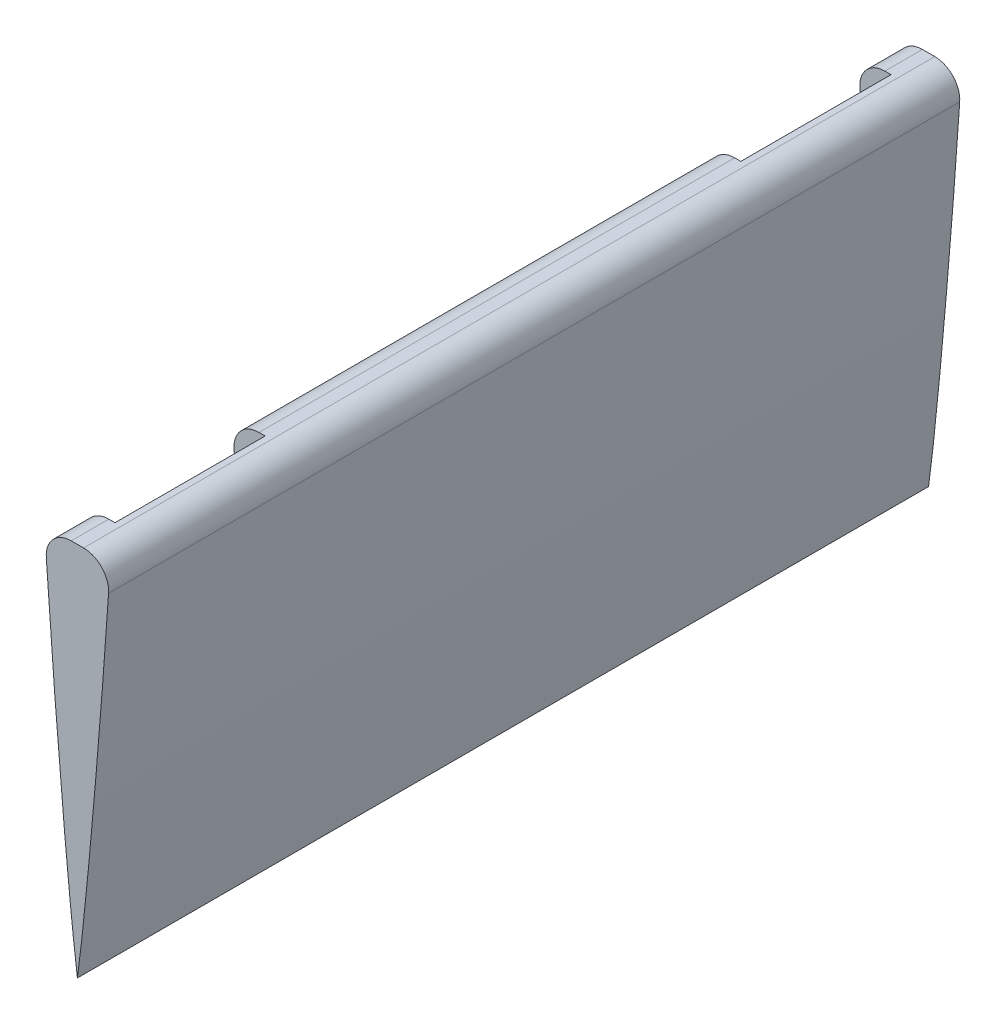
ISO-10303-21;
HEADER;
FILE_DESCRIPTION(('STEP AP214'),'2;1');
FILE_NAME('part.step','',(''),(''),'','','');
FILE_SCHEMA(('AUTOMOTIVE_DESIGN { 1 0 10303 214 1 1 1 1 }'));
ENDSEC;
DATA;
#1=APPLICATION_CONTEXT('core data for automotive mechanical design processes');
#2=APPLICATION_PROTOCOL_DEFINITION('international standard','automotive_design',2000,#1);
#3=PRODUCT_CONTEXT('',#1,'mechanical');
#4=PRODUCT('Part','Part','',(#3));
#5=PRODUCT_RELATED_PRODUCT_CATEGORY('part','',(#4));
#6=PRODUCT_DEFINITION_FORMATION('','',#4);
#7=PRODUCT_DEFINITION_CONTEXT('part definition',#1,'design');
#8=PRODUCT_DEFINITION('design','',#6,#7);
#9=PRODUCT_DEFINITION_SHAPE('','',#8);
#10=(LENGTH_UNIT() NAMED_UNIT(*) SI_UNIT(.MILLI.,.METRE.));
#11=(NAMED_UNIT(*) PLANE_ANGLE_UNIT() SI_UNIT($,.RADIAN.));
#12=(NAMED_UNIT(*) SI_UNIT($,.STERADIAN.) SOLID_ANGLE_UNIT());
#13=UNCERTAINTY_MEASURE_WITH_UNIT(LENGTH_MEASURE(1.E-05),#10,'distance_accuracy_value','');
#14=(GEOMETRIC_REPRESENTATION_CONTEXT(3) GLOBAL_UNCERTAINTY_ASSIGNED_CONTEXT((#13)) GLOBAL_UNIT_ASSIGNED_CONTEXT((#10,
#11,#12)) REPRESENTATION_CONTEXT('',''));
#15=CARTESIAN_POINT('',(0.,0.,0.));
#16=DIRECTION('',(0.,0.,1.));
#17=DIRECTION('',(1.,0.,0.));
#18=AXIS2_PLACEMENT_3D('',#15,#16,#17);
#19=CARTESIAN_POINT('',(-2.4886684159476,-667.135965963535,69.0000000000001));
#20=CARTESIAN_POINT('',(-2.42539379858326,-668.064554688061,69.0000000000001));
#21=CARTESIAN_POINT('',(-2.24900919174135,-670.58228504223,69.0000000000001));
#22=CARTESIAN_POINT('',(-1.95053516599277,-674.572636177726,69.0000000000001));
#23=CARTESIAN_POINT('',(-1.59558045491599,-678.965682707439,69.0000000000001));
#24=CARTESIAN_POINT('',(-1.2543479227875,-682.938251461165,69.0000000000001));
#25=CARTESIAN_POINT('',(-0.936673997120256,-686.422094746995,69.0000000000001));
#26=CARTESIAN_POINT('',(-0.649135542921568,-689.357660004493,69.0000000000001));
#27=CARTESIAN_POINT('',(-0.403246318074824,-691.694524122811,69.0000000000001));
#28=CARTESIAN_POINT('',(-0.207189019120028,-693.392683730012,69.0000000000001));
#29=CARTESIAN_POINT('',(-0.0904433778749418,-694.306731800449,69.0000000000001));
#30=CARTESIAN_POINT('',(-0.0463124999999785,-694.65225,69.0000000000001));
#31=B_SPLINE_CURVE_WITH_KNOTS('',3,(#19,#20,#21,#22,#23,#24,#25,#26,#27,#28,#29,#30),
.UNSPECIFIED.,.F.,.F.,(4,1,1,1,1,1,1,1,1,4),(0.0130459743979009,0.0300624816189242,
0.0591896904022461,0.0862039948092875,0.110640853612541,0.132086404942711,0.150162148552736,
0.164567507976323,0.175046194928288,0.181414509479025),.UNSPECIFIED.);
#32=DIRECTION('',(0.,0.,-1.));
#33=VECTOR('',#32,1.);
#34=SURFACE_OF_LINEAR_EXTRUSION('',#31,#33);
#35=CARTESIAN_POINT('',(-2.4886684159476,-667.135965963535,66.0000000000001));
#36=CARTESIAN_POINT('',(-2.42539379858326,-668.064554688061,66.0000000000001));
#37=CARTESIAN_POINT('',(-2.24900919174135,-670.58228504223,66.0000000000001));
#38=CARTESIAN_POINT('',(-1.95053516599277,-674.572636177726,66.0000000000001));
#39=CARTESIAN_POINT('',(-1.59558045491599,-678.965682707439,66.0000000000001));
#40=CARTESIAN_POINT('',(-1.2543479227875,-682.938251461165,66.0000000000001));
#41=CARTESIAN_POINT('',(-0.936673997120256,-686.422094746995,66.0000000000001));
#42=CARTESIAN_POINT('',(-0.649135542921568,-689.357660004493,66.0000000000001));
#43=CARTESIAN_POINT('',(-0.403246318074824,-691.694524122811,66.0000000000001));
#44=CARTESIAN_POINT('',(-0.207189019120028,-693.392683730012,66.0000000000001));
#45=CARTESIAN_POINT('',(-0.0904433778749418,-694.306731800449,66.0000000000001));
#46=CARTESIAN_POINT('',(-0.0463124999999785,-694.65225,66.0000000000001));
#47=B_SPLINE_CURVE_WITH_KNOTS('',3,(#35,#36,#37,#38,#39,#40,#41,#42,#43,#44,#45,#46),
.UNSPECIFIED.,.F.,.F.,(4,1,1,1,1,1,1,1,1,4),(0.0130459743979009,0.0300624816189242,
0.0591896904022461,0.0862039948092875,0.110640853612541,0.132086404942711,0.150162148552736,
0.164567507976323,0.175046194928288,0.181414509479025),.UNSPECIFIED.);
#48=CARTESIAN_POINT('',(-1.75338053031172,-677.,66.0000000000002));
#49=VERTEX_POINT('',#48);
#50=CARTESIAN_POINT('',(-2.4886684159476,-667.135965963535,66.0000000000002));
#51=VERTEX_POINT('',#50);
#52=EDGE_CURVE('E141',#49,#51,#47,.F.);
#53=ORIENTED_EDGE('',*,*,#52,.F.);
#54=DIRECTION('',(0.,0.,-1.));
#55=VECTOR('',#54,1.);
#56=CARTESIAN_POINT('',(-1.75338053031172,-677.,69.0000000000001));
#57=LINE('',#56,#55);
#58=CARTESIAN_POINT('',(-1.75338053031172,-677.,54.0000000000002));
#59=VERTEX_POINT('',#58);
#60=EDGE_CURVE('E11',#59,#49,#57,.F.);
#61=ORIENTED_EDGE('',*,*,#60,.F.);
#62=CARTESIAN_POINT('',(-2.4886684159476,-667.135965963535,54.0000000000002));
#63=CARTESIAN_POINT('',(-2.42539379858326,-668.064554688061,54.0000000000002));
#64=CARTESIAN_POINT('',(-2.24900919174135,-670.58228504223,54.0000000000002));
#65=CARTESIAN_POINT('',(-1.95053516599277,-674.572636177726,54.0000000000002));
#66=CARTESIAN_POINT('',(-1.59558045491599,-678.965682707439,54.0000000000002));
#67=CARTESIAN_POINT('',(-1.2543479227875,-682.938251461165,54.0000000000002));
#68=CARTESIAN_POINT('',(-0.936673997120256,-686.422094746995,54.0000000000002));
#69=CARTESIAN_POINT('',(-0.649135542921568,-689.357660004493,54.0000000000002));
#70=CARTESIAN_POINT('',(-0.403246318074824,-691.694524122811,54.0000000000002));
#71=CARTESIAN_POINT('',(-0.207189019120028,-693.392683730012,54.0000000000002));
#72=CARTESIAN_POINT('',(-0.0904433778749418,-694.306731800449,54.0000000000002));
#73=CARTESIAN_POINT('',(-0.0463124999999785,-694.65225,54.0000000000002));
#74=B_SPLINE_CURVE_WITH_KNOTS('',3,(#62,#63,#64,#65,#66,#67,#68,#69,#70,#71,#72,#73),
.UNSPECIFIED.,.F.,.F.,(4,1,1,1,1,1,1,1,1,4),(0.0130459743979009,0.0300624816189242,
0.0591896904022461,0.0862039948092875,0.110640853612541,0.132086404942711,0.150162148552736,
0.164567507976323,0.175046194928288,0.181414509479025),.UNSPECIFIED.);
#75=CARTESIAN_POINT('',(-2.4886684159476,-667.135965963535,54.0000000000002));
#76=VERTEX_POINT('',#75);
#77=EDGE_CURVE('E218',#76,#59,#74,.T.);
#78=ORIENTED_EDGE('',*,*,#77,.F.);
#79=DIRECTION('',(0.,0.,-1.));
#80=VECTOR('',#79,1.);
#81=CARTESIAN_POINT('',(-2.4886684159476,-667.135965963535,69.0000000000001));
#82=LINE('',#81,#80);
#83=CARTESIAN_POINT('',(-2.4886684159476,-667.135965963535,16.));
#84=VERTEX_POINT('',#83);
#85=EDGE_CURVE('E162',#76,#84,#82,.T.);
#86=ORIENTED_EDGE('',*,*,#85,.T.);
#87=CARTESIAN_POINT('',(-2.4886684159476,-667.135965963535,16.));
#88=CARTESIAN_POINT('',(-2.42539379858326,-668.064554688061,16.));
#89=CARTESIAN_POINT('',(-2.24900919174135,-670.58228504223,16.));
#90=CARTESIAN_POINT('',(-1.95053516599277,-674.572636177726,16.));
#91=CARTESIAN_POINT('',(-1.59558045491599,-678.965682707439,16.));
#92=CARTESIAN_POINT('',(-1.2543479227875,-682.938251461165,16.));
#93=CARTESIAN_POINT('',(-0.936673997120256,-686.422094746995,16.));
#94=CARTESIAN_POINT('',(-0.649135542921568,-689.357660004493,16.));
#95=CARTESIAN_POINT('',(-0.403246318074824,-691.694524122811,16.));
#96=CARTESIAN_POINT('',(-0.207189019120028,-693.392683730012,16.));
#97=CARTESIAN_POINT('',(-0.0904433778749418,-694.306731800449,16.));
#98=CARTESIAN_POINT('',(-0.0463124999999785,-694.65225,16.));
#99=B_SPLINE_CURVE_WITH_KNOTS('',3,(#87,#88,#89,#90,#91,#92,#93,#94,#95,#96,#97,#98),
.UNSPECIFIED.,.F.,.F.,(4,1,1,1,1,1,1,1,1,4),(0.0130459743979009,0.0300624816189242,
0.0591896904022461,0.0862039948092875,0.110640853612541,0.132086404942711,0.150162148552736,
0.164567507976323,0.175046194928288,0.181414509479025),.UNSPECIFIED.);
#100=CARTESIAN_POINT('',(-1.75338053031172,-677.,16.));
#101=VERTEX_POINT('',#100);
#102=EDGE_CURVE('E207',#101,#84,#99,.F.);
#103=ORIENTED_EDGE('',*,*,#102,.F.);
#104=DIRECTION('',(0.,0.,-1.));
#105=VECTOR('',#104,1.);
#106=CARTESIAN_POINT('',(-1.75338053031172,-677.,69.0000000000001));
#107=LINE('',#106,#105);
#108=CARTESIAN_POINT('',(-1.75338053031172,-677.,4.00000000000003));
#109=VERTEX_POINT('',#108);
#110=EDGE_CURVE('E50',#109,#101,#107,.F.);
#111=ORIENTED_EDGE('',*,*,#110,.F.);
#112=CARTESIAN_POINT('',(-2.4886684159476,-667.135965963535,4.00000000000002));
#113=CARTESIAN_POINT('',(-2.42539379858326,-668.064554688061,4.00000000000002));
#114=CARTESIAN_POINT('',(-2.24900919174135,-670.58228504223,4.00000000000002));
#115=CARTESIAN_POINT('',(-1.95053516599277,-674.572636177726,4.00000000000002));
#116=CARTESIAN_POINT('',(-1.59558045491599,-678.965682707439,4.00000000000002));
#117=CARTESIAN_POINT('',(-1.2543479227875,-682.938251461165,4.00000000000002));
#118=CARTESIAN_POINT('',(-0.936673997120256,-686.422094746995,4.00000000000002));
#119=CARTESIAN_POINT('',(-0.649135542921568,-689.357660004493,4.00000000000002));
#120=CARTESIAN_POINT('',(-0.403246318074824,-691.694524122811,4.00000000000002));
#121=CARTESIAN_POINT('',(-0.207189019120028,-693.392683730012,4.00000000000002));
#122=CARTESIAN_POINT('',(-0.0904433778749418,-694.306731800449,4.00000000000002));
#123=CARTESIAN_POINT('',(-0.0463124999999785,-694.65225,4.00000000000002));
#124=B_SPLINE_CURVE_WITH_KNOTS('',3,(#112,#113,#114,#115,#116,#117,#118,#119,#120,#121,#122,
#123),.UNSPECIFIED.,.F.,.F.,(4,1,1,1,1,1,1,1,1,4),(0.0130459743979009,0.0300624816189242,
0.0591896904022461,0.0862039948092875,0.110640853612541,0.132086404942711,0.150162148552736,
0.164567507976323,0.175046194928288,0.181414509479025),.UNSPECIFIED.);
#125=CARTESIAN_POINT('',(-2.4886684159476,-667.135965963535,4.00000000000003));
#126=VERTEX_POINT('',#125);
#127=EDGE_CURVE('E219',#126,#109,#124,.T.);
#128=ORIENTED_EDGE('',*,*,#127,.F.);
#129=CARTESIAN_POINT('',(-2.4886684159476,-667.135965963535,1.00000000000007));
#130=VERTEX_POINT('',#129);
#131=EDGE_CURVE('E90',#126,#130,#82,.T.);
#132=ORIENTED_EDGE('',*,*,#131,.T.);
#133=CARTESIAN_POINT('',(-2.4886684159476,-667.135965963535,1.00000000000007));
#134=CARTESIAN_POINT('',(-2.42539379858326,-668.064554688061,1.00000000000007));
#135=CARTESIAN_POINT('',(-2.24900919174135,-670.58228504223,1.00000000000007));
#136=CARTESIAN_POINT('',(-1.95053516599277,-674.572636177726,1.00000000000007));
#137=CARTESIAN_POINT('',(-1.59558045491599,-678.965682707439,1.00000000000007));
#138=CARTESIAN_POINT('',(-1.2543479227875,-682.938251461165,1.00000000000007));
#139=CARTESIAN_POINT('',(-0.936673997120256,-686.422094746995,1.00000000000007));
#140=CARTESIAN_POINT('',(-0.649135542921568,-689.357660004493,1.00000000000007));
#141=CARTESIAN_POINT('',(-0.403246318074824,-691.694524122811,1.00000000000007));
#142=CARTESIAN_POINT('',(-0.207189019120028,-693.392683730012,1.00000000000007));
#143=CARTESIAN_POINT('',(-0.0904433778749418,-694.306731800449,1.00000000000007));
#144=CARTESIAN_POINT('',(-0.0463124999999785,-694.65225,1.00000000000007));
#145=B_SPLINE_CURVE_WITH_KNOTS('',3,(#133,#134,#135,#136,#137,#138,#139,#140,#141,#142,#143,
#144),.UNSPECIFIED.,.F.,.F.,(4,1,1,1,1,1,1,1,1,4),(0.0130459743979009,0.0300624816189242,
0.0591896904022461,0.0862039948092875,0.110640853612541,0.132086404942711,0.150162148552736,
0.164567507976323,0.175046194928288,0.181414509479025),.UNSPECIFIED.);
#146=CARTESIAN_POINT('',(-0.0463124999999785,-694.65225,1.00000000000007));
#147=VERTEX_POINT('',#146);
#148=EDGE_CURVE('E136',#130,#147,#145,.T.);
#149=ORIENTED_EDGE('',*,*,#148,.T.);
#150=DIRECTION('',(0.,0.,-1.));
#151=VECTOR('',#150,1.);
#152=CARTESIAN_POINT('',(-0.0463124999999785,-694.65225,69.0000000000001));
#153=LINE('',#152,#151);
#154=CARTESIAN_POINT('',(-0.0463124999999785,-694.65225,69.0000000000001));
#155=VERTEX_POINT('',#154);
#156=EDGE_CURVE('E170',#155,#147,#153,.T.);
#157=ORIENTED_EDGE('',*,*,#156,.F.);
#158=CARTESIAN_POINT('',(-2.4886684159476,-667.135965963535,69.0000000000001));
#159=VERTEX_POINT('',#158);
#160=EDGE_CURVE('E158',#159,#155,#31,.T.);
#161=ORIENTED_EDGE('',*,*,#160,.F.);
#162=EDGE_CURVE('E159',#159,#51,#82,.T.);
#163=ORIENTED_EDGE('',*,*,#162,.T.);
#164=EDGE_LOOP('',(#53,#61,#78,#86,#103,#111,#128,#132,#149,#157,#161,#163));
#165=FACE_BOUND('',#164,.T.);
#166=ADVANCED_FACE('F41',(#165),#34,.F.);
#167=CARTESIAN_POINT('',(-0.493295454128175,-665.,69.0000000000001));
#168=DIRECTION('',(2.25062452770313E-13,-1.,0.));
#169=DIRECTION('',(1.,2.25062452770313E-13,0.));
#170=AXIS2_PLACEMENT_3D('',#167,#168,#169);
#171=PLANE('',#170);
#172=DIRECTION('',(1.,0.,0.));
#173=VECTOR('',#172,1.);
#174=CARTESIAN_POINT('',(-2.4932954541282,-665.,66.0000000000002));
#175=LINE('',#174,#173);
#176=CARTESIAN_POINT('',(-0.493295454128205,-665.,66.0000000000002));
#177=VERTEX_POINT('',#176);
#178=CARTESIAN_POINT('',(0.,-665.,66.0000000000002));
#179=VERTEX_POINT('',#178);
#180=EDGE_CURVE('E224',#177,#179,#175,.T.);
#181=ORIENTED_EDGE('',*,*,#180,.F.);
#182=DIRECTION('',(0.,0.,-1.));
#183=VECTOR('',#182,1.);
#184=CARTESIAN_POINT('',(-0.493295454128175,-665.,69.0000000000001));
#185=LINE('',#184,#183);
#186=CARTESIAN_POINT('',(-0.493295454128175,-665.,69.0000000000001));
#187=VERTEX_POINT('',#186);
#188=EDGE_CURVE('E127',#187,#177,#185,.T.);
#189=ORIENTED_EDGE('',*,*,#188,.F.);
#190=DIRECTION('',(-1.,-2.25062452770313E-13,0.));
#191=VECTOR('',#190,1.);
#192=CARTESIAN_POINT('',(-0.493295454128175,-665.,69.0000000000001));
#193=LINE('',#192,#191);
#194=CARTESIAN_POINT('',(0.49329561067124,-665.,69.0000000000001));
#195=VERTEX_POINT('',#194);
#196=EDGE_CURVE('E111',#195,#187,#193,.T.);
#197=ORIENTED_EDGE('',*,*,#196,.F.);
#198=DIRECTION('',(0.,0.,-1.));
#199=VECTOR('',#198,1.);
#200=CARTESIAN_POINT('',(0.49329561067124,-665.,69.0000000000001));
#201=LINE('',#200,#199);
#202=CARTESIAN_POINT('',(0.49329561067124,-665.,1.00000000000007));
#203=VERTEX_POINT('',#202);
#204=EDGE_CURVE('E120',#195,#203,#201,.T.);
#205=ORIENTED_EDGE('',*,*,#204,.T.);
#206=DIRECTION('',(-1.,-2.25062452770313E-13,0.));
#207=VECTOR('',#206,1.);
#208=CARTESIAN_POINT('',(-0.493295454128175,-665.,1.00000000000007));
#209=LINE('',#208,#207);
#210=CARTESIAN_POINT('',(-0.493295454128175,-665.,1.00000000000007));
#211=VERTEX_POINT('',#210);
#212=EDGE_CURVE('E154',#203,#211,#209,.T.);
#213=ORIENTED_EDGE('',*,*,#212,.T.);
#214=CARTESIAN_POINT('',(-0.493295454128205,-665.,4.00000000000003));
#215=VERTEX_POINT('',#214);
#216=EDGE_CURVE('E82',#215,#211,#185,.T.);
#217=ORIENTED_EDGE('',*,*,#216,.F.);
#218=DIRECTION('',(1.,0.,0.));
#219=VECTOR('',#218,1.);
#220=CARTESIAN_POINT('',(-2.4932954541282,-665.,4.00000000000003));
#221=LINE('',#220,#219);
#222=CARTESIAN_POINT('',(0.,-665.,4.00000000000003));
#223=VERTEX_POINT('',#222);
#224=EDGE_CURVE('E364',#215,#223,#221,.T.);
#225=ORIENTED_EDGE('',*,*,#224,.T.);
#226=DIRECTION('',(0.,0.,-1.));
#227=VECTOR('',#226,1.);
#228=CARTESIAN_POINT('',(0.,-665.,16.));
#229=LINE('',#228,#227);
#230=CARTESIAN_POINT('',(0.,-665.,16.));
#231=VERTEX_POINT('',#230);
#232=EDGE_CURVE('E356',#231,#223,#229,.T.);
#233=ORIENTED_EDGE('',*,*,#232,.F.);
#234=DIRECTION('',(1.,0.,0.));
#235=VECTOR('',#234,1.);
#236=CARTESIAN_POINT('',(-2.4932954541282,-665.,16.));
#237=LINE('',#236,#235);
#238=CARTESIAN_POINT('',(-0.493295454128205,-665.,16.));
#239=VERTEX_POINT('',#238);
#240=EDGE_CURVE('E335',#239,#231,#237,.T.);
#241=ORIENTED_EDGE('',*,*,#240,.F.);
#242=CARTESIAN_POINT('',(-0.493295454128205,-665.,54.0000000000002));
#243=VERTEX_POINT('',#242);
#244=EDGE_CURVE('E163',#243,#239,#185,.T.);
#245=ORIENTED_EDGE('',*,*,#244,.F.);
#246=DIRECTION('',(1.,0.,0.));
#247=VECTOR('',#246,1.);
#248=CARTESIAN_POINT('',(-2.4932954541282,-665.,54.0000000000002));
#249=LINE('',#248,#247);
#250=CARTESIAN_POINT('',(0.,-665.,54.0000000000002));
#251=VERTEX_POINT('',#250);
#252=EDGE_CURVE('E341',#243,#251,#249,.T.);
#253=ORIENTED_EDGE('',*,*,#252,.T.);
#254=DIRECTION('',(0.,0.,-1.));
#255=VECTOR('',#254,1.);
#256=CARTESIAN_POINT('',(0.,-665.,66.0000000000002));
#257=LINE('',#256,#255);
#258=EDGE_CURVE('E327',#179,#251,#257,.T.);
#259=ORIENTED_EDGE('',*,*,#258,.F.);
#260=EDGE_LOOP('',(#181,#189,#197,#205,#213,#217,#225,#233,#241,#245,#253,#259));
#261=FACE_BOUND('',#260,.T.);
#262=ADVANCED_FACE('F130',(#261),#171,.F.);
#263=CARTESIAN_POINT('',(-0.493295454128205,-667.,69.0000000000001));
#264=DIRECTION('',(0.,0.,-1.));
#265=DIRECTION('',(-1.,0.,0.));
#266=AXIS2_PLACEMENT_3D('',#263,#264,#265);
#267=CYLINDRICAL_SURFACE('',#266,2.);
#268=CARTESIAN_POINT('',(-0.493295454128205,-667.,66.0000000000002));
#269=DIRECTION('',(0.,0.,-1.));
#270=DIRECTION('',(0.,1.,0.));
#271=AXIS2_PLACEMENT_3D('',#268,#269,#270);
#272=CIRCLE('',#271,2.);
#273=EDGE_CURVE('E182',#51,#177,#272,.T.);
#274=ORIENTED_EDGE('',*,*,#273,.F.);
#275=ORIENTED_EDGE('',*,*,#162,.F.);
#276=CARTESIAN_POINT('',(-0.493295454128205,-667.,69.0000000000001));
#277=DIRECTION('',(0.,0.,1.));
#278=DIRECTION('',(-1.,0.,0.));
#279=AXIS2_PLACEMENT_3D('',#276,#277,#278);
#280=CIRCLE('',#279,2.);
#281=EDGE_CURVE('E58',#187,#159,#280,.T.);
#282=ORIENTED_EDGE('',*,*,#281,.F.);
#283=ORIENTED_EDGE('',*,*,#188,.T.);
#284=EDGE_LOOP('',(#274,#275,#282,#283));
#285=FACE_BOUND('',#284,.T.);
#286=ADVANCED_FACE('F273',(#285),#267,.T.);
#287=CARTESIAN_POINT('',(-0.493295454128205,-667.,54.0000000000002));
#288=DIRECTION('',(0.,0.,1.));
#289=DIRECTION('',(1.,0.,0.));
#290=AXIS2_PLACEMENT_3D('',#287,#288,#289);
#291=CIRCLE('',#290,2.);
#292=EDGE_CURVE('E179',#243,#76,#291,.T.);
#293=ORIENTED_EDGE('',*,*,#292,.F.);
#294=ORIENTED_EDGE('',*,*,#244,.T.);
#295=CARTESIAN_POINT('',(-0.493295454128205,-667.,16.));
#296=DIRECTION('',(0.,0.,-1.));
#297=DIRECTION('',(-1.,0.,0.));
#298=AXIS2_PLACEMENT_3D('',#295,#296,#297);
#299=CIRCLE('',#298,2.);
#300=EDGE_CURVE('E176',#84,#239,#299,.T.);
#301=ORIENTED_EDGE('',*,*,#300,.F.);
#302=ORIENTED_EDGE('',*,*,#85,.F.);
#303=EDGE_LOOP('',(#293,#294,#301,#302));
#304=FACE_BOUND('',#303,.T.);
#305=ADVANCED_FACE('F271',(#304),#267,.T.);
#306=CARTESIAN_POINT('',(-0.493295454128205,-667.,4.00000000000003));
#307=DIRECTION('',(0.,0.,1.));
#308=DIRECTION('',(0.,-1.,0.));
#309=AXIS2_PLACEMENT_3D('',#306,#307,#308);
#310=CIRCLE('',#309,2.);
#311=EDGE_CURVE('E173',#215,#126,#310,.T.);
#312=ORIENTED_EDGE('',*,*,#311,.F.);
#313=ORIENTED_EDGE('',*,*,#216,.T.);
#314=CARTESIAN_POINT('',(-0.493295454128205,-667.,1.00000000000007));
#315=DIRECTION('',(0.,0.,1.));
#316=DIRECTION('',(-1.,0.,0.));
#317=AXIS2_PLACEMENT_3D('',#314,#315,#316);
#318=CIRCLE('',#317,2.);
#319=EDGE_CURVE('E156',#211,#130,#318,.T.);
#320=ORIENTED_EDGE('',*,*,#319,.T.);
#321=ORIENTED_EDGE('',*,*,#131,.F.);
#322=EDGE_LOOP('',(#312,#313,#320,#321));
#323=FACE_BOUND('',#322,.T.);
#324=ADVANCED_FACE('F267',(#323),#267,.T.);
#325=CARTESIAN_POINT('',(-0.0463124999999785,-694.65225,69.0000000000001));
#326=DIRECTION('',(0.991248116150498,0.132012015468629,0.));
#327=DIRECTION('',(-0.132012015468629,0.991248116150498,0.));
#328=AXIS2_PLACEMENT_3D('',#325,#326,#327);
#329=PLANE('',#328);
#330=DIRECTION('',(0.132012015468629,-0.991248116150498,0.));
#331=VECTOR('',#330,1.);
#332=CARTESIAN_POINT('',(-0.0463124999999785,-694.65225,1.00000000000007));
#333=LINE('',#332,#331);
#334=CARTESIAN_POINT('',(0.,-695.,1.00000000000007));
#335=VERTEX_POINT('',#334);
#336=EDGE_CURVE('E140',#147,#335,#333,.T.);
#337=ORIENTED_EDGE('',*,*,#336,.T.);
#338=DIRECTION('',(0.,0.,-1.));
#339=VECTOR('',#338,1.);
#340=CARTESIAN_POINT('',(0.,-695.,69.0000000000001));
#341=LINE('',#340,#339);
#342=CARTESIAN_POINT('',(0.,-695.,69.0000000000001));
#343=VERTEX_POINT('',#342);
#344=EDGE_CURVE('E166',#343,#335,#341,.T.);
#345=ORIENTED_EDGE('',*,*,#344,.F.);
#346=DIRECTION('',(0.132012015468629,-0.991248116150498,0.));
#347=VECTOR('',#346,1.);
#348=CARTESIAN_POINT('',(-0.0463124999999785,-694.65225,69.0000000000001));
#349=LINE('',#348,#347);
#350=EDGE_CURVE('E98',#155,#343,#349,.T.);
#351=ORIENTED_EDGE('',*,*,#350,.F.);
#352=ORIENTED_EDGE('',*,*,#156,.T.);
#353=EDGE_LOOP('',(#337,#345,#351,#352));
#354=FACE_BOUND('',#353,.T.);
#355=ADVANCED_FACE('F263',(#354),#329,.F.);
#356=CARTESIAN_POINT('',(0.,-695.,69.0000000000001));
#357=CARTESIAN_POINT('',(0.0155220726936815,-694.884094444943,69.0000000000001));
#358=CARTESIAN_POINT('',(0.0772789265039087,-694.422947112321,69.0000000000001));
#359=CARTESIAN_POINT('',(0.206148599416014,-693.392547034144,69.0000000000001));
#360=CARTESIAN_POINT('',(0.403716275844514,-691.694585868359,69.0000000000001));
#361=CARTESIAN_POINT('',(0.648953840791184,-689.357636131502,69.0000000000001));
#362=CARTESIAN_POINT('',(0.936738042792572,-686.422103161655,69.0000000000001));
#363=CARTESIAN_POINT('',(1.2543267550035,-682.938248680029,69.0000000000001));
#364=CARTESIAN_POINT('',(1.59558712219755,-678.965683583422,69.0000000000001));
#365=CARTESIAN_POINT('',(1.95053314593904,-674.57263591232,69.0000000000001));
#366=CARTESIAN_POINT('',(2.2490093743402,-670.5822850249,69.0000000000001));
#367=CARTESIAN_POINT('',(2.42539400678092,-668.064554632797,69.0000000000001));
#368=CARTESIAN_POINT('',(2.48866857947029,-667.135965861106,69.0000000000001));
#369=B_SPLINE_CURVE_WITH_KNOTS('',3,(#356,#357,#358,#359,#360,#361,#362,#363,#364,#365,#366,
#367,#368),.UNSPECIFIED.,.F.,.F.,(4,1,1,1,1,1,1,1,1,1,4),(0.816447501776426,0.818585490515755,
0.824953805066492,0.835432492018457,0.849837851442043,0.867913595052069,0.889359146382239,
0.913796005185492,0.940810309592534,0.969937518375856,0.986954026347075),.UNSPECIFIED.);
#370=DIRECTION('',(0.,0.,-1.));
#371=VECTOR('',#370,1.);
#372=SURFACE_OF_LINEAR_EXTRUSION('',#369,#371);
#373=CARTESIAN_POINT('',(0.,-695.,1.00000000000007));
#374=CARTESIAN_POINT('',(0.0155220726936815,-694.884094444943,1.00000000000007));
#375=CARTESIAN_POINT('',(0.0772789265039087,-694.422947112321,1.00000000000007));
#376=CARTESIAN_POINT('',(0.206148599416014,-693.392547034144,1.00000000000007));
#377=CARTESIAN_POINT('',(0.403716275844514,-691.694585868359,1.00000000000007));
#378=CARTESIAN_POINT('',(0.648953840791184,-689.357636131502,1.00000000000007));
#379=CARTESIAN_POINT('',(0.936738042792572,-686.422103161655,1.00000000000007));
#380=CARTESIAN_POINT('',(1.2543267550035,-682.938248680029,1.00000000000007));
#381=CARTESIAN_POINT('',(1.59558712219755,-678.965683583422,1.00000000000007));
#382=CARTESIAN_POINT('',(1.95053314593904,-674.57263591232,1.00000000000007));
#383=CARTESIAN_POINT('',(2.2490093743402,-670.5822850249,1.00000000000007));
#384=CARTESIAN_POINT('',(2.42539400678092,-668.064554632797,1.00000000000007));
#385=CARTESIAN_POINT('',(2.48866857947029,-667.135965861106,1.00000000000007));
#386=B_SPLINE_CURVE_WITH_KNOTS('',3,(#373,#374,#375,#376,#377,#378,#379,#380,#381,#382,#383,
#384,#385),.UNSPECIFIED.,.F.,.F.,(4,1,1,1,1,1,1,1,1,1,4),(0.816447501776426,0.818585490515755,
0.824953805066492,0.835432492018457,0.849837851442043,0.867913595052069,0.889359146382239,
0.913796005185492,0.940810309592534,0.969937518375856,0.986954026347075),.UNSPECIFIED.);
#387=CARTESIAN_POINT('',(2.48866857947029,-667.135965861106,1.00000000000007));
#388=VERTEX_POINT('',#387);
#389=EDGE_CURVE('E146',#335,#388,#386,.T.);
#390=ORIENTED_EDGE('',*,*,#389,.T.);
#391=DIRECTION('',(0.,0.,-1.));
#392=VECTOR('',#391,1.);
#393=CARTESIAN_POINT('',(2.48866857947029,-667.135965861106,69.0000000000001));
#394=LINE('',#393,#392);
#395=CARTESIAN_POINT('',(2.48866857947029,-667.135965861106,69.0000000000001));
#396=VERTEX_POINT('',#395);
#397=EDGE_CURVE('E126',#396,#388,#394,.T.);
#398=ORIENTED_EDGE('',*,*,#397,.F.);
#399=EDGE_CURVE('E114',#343,#396,#369,.T.);
#400=ORIENTED_EDGE('',*,*,#399,.F.);
#401=ORIENTED_EDGE('',*,*,#344,.T.);
#402=EDGE_LOOP('',(#390,#398,#400,#401));
#403=FACE_BOUND('',#402,.T.);
#404=ADVANCED_FACE('F260',(#403),#372,.F.);
#405=CARTESIAN_POINT('',(0.493295610671315,-667.,69.0000000000001));
#406=DIRECTION('',(0.,0.,-1.));
#407=DIRECTION('',(-1.,0.,0.));
#408=AXIS2_PLACEMENT_3D('',#405,#406,#407);
#409=CYLINDRICAL_SURFACE('',#408,2.00000000000001);
#410=CARTESIAN_POINT('',(0.493295610671315,-667.,1.00000000000007));
#411=DIRECTION('',(0.,0.,1.));
#412=DIRECTION('',(1.,0.,0.));
#413=AXIS2_PLACEMENT_3D('',#410,#411,#412);
#414=CIRCLE('',#413,2.00000000000001);
#415=EDGE_CURVE('E123',#388,#203,#414,.T.);
#416=ORIENTED_EDGE('',*,*,#415,.T.);
#417=ORIENTED_EDGE('',*,*,#204,.F.);
#418=CARTESIAN_POINT('',(0.493295610671315,-667.,69.0000000000001));
#419=DIRECTION('',(0.,0.,1.));
#420=DIRECTION('',(1.,0.,0.));
#421=AXIS2_PLACEMENT_3D('',#418,#419,#420);
#422=CIRCLE('',#421,2.00000000000001);
#423=EDGE_CURVE('E107',#396,#195,#422,.T.);
#424=ORIENTED_EDGE('',*,*,#423,.F.);
#425=ORIENTED_EDGE('',*,*,#397,.T.);
#426=EDGE_LOOP('',(#416,#417,#424,#425));
#427=FACE_BOUND('',#426,.T.);
#428=ADVANCED_FACE('F121',(#427),#409,.T.);
#429=CARTESIAN_POINT('',(-1.42780124034702,-680.908722710936,69.0000000000001));
#430=DIRECTION('',(0.,0.,-1.));
#431=DIRECTION('',(-1.,0.,0.));
#432=AXIS2_PLACEMENT_3D('',#429,#430,#431);
#433=PLANE('',#432);
#434=ORIENTED_EDGE('',*,*,#160,.T.);
#435=ORIENTED_EDGE('',*,*,#350,.T.);
#436=ORIENTED_EDGE('',*,*,#399,.T.);
#437=ORIENTED_EDGE('',*,*,#423,.T.);
#438=ORIENTED_EDGE('',*,*,#196,.T.);
#439=ORIENTED_EDGE('',*,*,#281,.T.);
#440=EDGE_LOOP('',(#434,#435,#436,#437,#438,#439));
#441=FACE_BOUND('',#440,.T.);
#442=ADVANCED_FACE('F109',(#441),#433,.F.);
#443=CARTESIAN_POINT('',(-1.42780124034702,-680.908722710936,1.00000000000007));
#444=DIRECTION('',(0.,0.,-1.));
#445=DIRECTION('',(-1.,0.,0.));
#446=AXIS2_PLACEMENT_3D('',#443,#444,#445);
#447=PLANE('',#446);
#448=ORIENTED_EDGE('',*,*,#148,.F.);
#449=ORIENTED_EDGE('',*,*,#319,.F.);
#450=ORIENTED_EDGE('',*,*,#212,.F.);
#451=ORIENTED_EDGE('',*,*,#415,.F.);
#452=ORIENTED_EDGE('',*,*,#389,.F.);
#453=ORIENTED_EDGE('',*,*,#336,.F.);
#454=EDGE_LOOP('',(#448,#449,#450,#451,#452,#453));
#455=FACE_BOUND('',#454,.T.);
#456=ADVANCED_FACE('F283',(#455),#447,.T.);
#457=CARTESIAN_POINT('',(-2.4932954541282,-677.,16.));
#458=DIRECTION('',(0.,1.,0.));
#459=DIRECTION('',(0.,0.,1.));
#460=AXIS2_PLACEMENT_3D('',#457,#458,#459);
#461=PLANE('',#460);
#462=ORIENTED_EDGE('',*,*,#110,.T.);
#463=DIRECTION('',(1.,0.,0.));
#464=VECTOR('',#463,1.);
#465=CARTESIAN_POINT('',(-2.4932954541282,-677.,16.));
#466=LINE('',#465,#464);
#467=CARTESIAN_POINT('',(0.,-677.,16.));
#468=VERTEX_POINT('',#467);
#469=EDGE_CURVE('E194',#101,#468,#466,.T.);
#470=ORIENTED_EDGE('',*,*,#469,.T.);
#471=DIRECTION('',(0.,0.,1.));
#472=VECTOR('',#471,1.);
#473=CARTESIAN_POINT('',(0.,-677.,16.));
#474=LINE('',#473,#472);
#475=CARTESIAN_POINT('',(0.,-677.,4.00000000000003));
#476=VERTEX_POINT('',#475);
#477=EDGE_CURVE('E212',#476,#468,#474,.T.);
#478=ORIENTED_EDGE('',*,*,#477,.F.);
#479=DIRECTION('',(1.,0.,0.));
#480=VECTOR('',#479,1.);
#481=CARTESIAN_POINT('',(-2.4932954541282,-677.,4.00000000000003));
#482=LINE('',#481,#480);
#483=EDGE_CURVE('E198',#109,#476,#482,.T.);
#484=ORIENTED_EDGE('',*,*,#483,.F.);
#485=EDGE_LOOP('',(#462,#470,#478,#484));
#486=FACE_BOUND('',#485,.T.);
#487=ADVANCED_FACE('F191',(#486),#461,.T.);
#488=CARTESIAN_POINT('',(-2.4932954541282,-665.,16.));
#489=DIRECTION('',(0.,0.,-1.));
#490=DIRECTION('',(-1.,0.,0.));
#491=AXIS2_PLACEMENT_3D('',#488,#489,#490);
#492=PLANE('',#491);
#493=ORIENTED_EDGE('',*,*,#102,.T.);
#494=ORIENTED_EDGE('',*,*,#300,.T.);
#495=ORIENTED_EDGE('',*,*,#240,.T.);
#496=DIRECTION('',(0.,1.,0.));
#497=VECTOR('',#496,1.);
#498=CARTESIAN_POINT('',(0.,-665.,16.));
#499=LINE('',#498,#497);
#500=EDGE_CURVE('E211',#468,#231,#499,.T.);
#501=ORIENTED_EDGE('',*,*,#500,.F.);
#502=ORIENTED_EDGE('',*,*,#469,.F.);
#503=EDGE_LOOP('',(#493,#494,#495,#501,#502));
#504=FACE_BOUND('',#503,.T.);
#505=ADVANCED_FACE('F206',(#504),#492,.T.);
#506=CARTESIAN_POINT('',(-2.4932954541282,-665.,4.00000000000003));
#507=DIRECTION('',(0.,0.,1.));
#508=DIRECTION('',(0.,-1.,0.));
#509=AXIS2_PLACEMENT_3D('',#506,#507,#508);
#510=PLANE('',#509);
#511=ORIENTED_EDGE('',*,*,#127,.T.);
#512=ORIENTED_EDGE('',*,*,#483,.T.);
#513=DIRECTION('',(0.,-1.,0.));
#514=VECTOR('',#513,1.);
#515=CARTESIAN_POINT('',(0.,-665.,4.00000000000003));
#516=LINE('',#515,#514);
#517=EDGE_CURVE('E359',#223,#476,#516,.T.);
#518=ORIENTED_EDGE('',*,*,#517,.F.);
#519=ORIENTED_EDGE('',*,*,#224,.F.);
#520=ORIENTED_EDGE('',*,*,#311,.T.);
#521=EDGE_LOOP('',(#511,#512,#518,#519,#520));
#522=FACE_BOUND('',#521,.T.);
#523=ADVANCED_FACE('F291',(#522),#510,.T.);
#524=CARTESIAN_POINT('',(0.,0.,0.));
#525=DIRECTION('',(1.,0.,0.));
#526=DIRECTION('',(0.,0.,-1.));
#527=AXIS2_PLACEMENT_3D('',#524,#525,#526);
#528=PLANE('',#527);
#529=ORIENTED_EDGE('',*,*,#500,.T.);
#530=ORIENTED_EDGE('',*,*,#232,.T.);
#531=ORIENTED_EDGE('',*,*,#517,.T.);
#532=ORIENTED_EDGE('',*,*,#477,.T.);
#533=EDGE_LOOP('',(#529,#530,#531,#532));
#534=FACE_BOUND('',#533,.T.);
#535=ADVANCED_FACE('F294',(#534),#528,.F.);
#536=CARTESIAN_POINT('',(-2.4932954541282,-677.,66.0000000000002));
#537=DIRECTION('',(0.,1.,0.));
#538=DIRECTION('',(0.,0.,1.));
#539=AXIS2_PLACEMENT_3D('',#536,#537,#538);
#540=PLANE('',#539);
#541=ORIENTED_EDGE('',*,*,#60,.T.);
#542=DIRECTION('',(1.,0.,0.));
#543=VECTOR('',#542,1.);
#544=CARTESIAN_POINT('',(-2.4932954541282,-677.,66.0000000000002));
#545=LINE('',#544,#543);
#546=CARTESIAN_POINT('',(0.,-677.,66.0000000000002));
#547=VERTEX_POINT('',#546);
#548=EDGE_CURVE('E347',#49,#547,#545,.T.);
#549=ORIENTED_EDGE('',*,*,#548,.T.);
#550=DIRECTION('',(0.,0.,1.));
#551=VECTOR('',#550,1.);
#552=CARTESIAN_POINT('',(0.,-677.,66.0000000000002));
#553=LINE('',#552,#551);
#554=CARTESIAN_POINT('',(0.,-677.,54.0000000000002));
#555=VERTEX_POINT('',#554);
#556=EDGE_CURVE('E331',#555,#547,#553,.T.);
#557=ORIENTED_EDGE('',*,*,#556,.F.);
#558=DIRECTION('',(1.,0.,0.));
#559=VECTOR('',#558,1.);
#560=CARTESIAN_POINT('',(-2.4932954541282,-677.,54.0000000000002));
#561=LINE('',#560,#559);
#562=EDGE_CURVE('E350',#59,#555,#561,.T.);
#563=ORIENTED_EDGE('',*,*,#562,.F.);
#564=EDGE_LOOP('',(#541,#549,#557,#563));
#565=FACE_BOUND('',#564,.T.);
#566=ADVANCED_FACE('F300',(#565),#540,.T.);
#567=CARTESIAN_POINT('',(-2.4932954541282,-665.,66.0000000000002));
#568=DIRECTION('',(0.,0.,-1.));
#569=DIRECTION('',(0.,1.,0.));
#570=AXIS2_PLACEMENT_3D('',#567,#568,#569);
#571=PLANE('',#570);
#572=ORIENTED_EDGE('',*,*,#52,.T.);
#573=ORIENTED_EDGE('',*,*,#273,.T.);
#574=ORIENTED_EDGE('',*,*,#180,.T.);
#575=DIRECTION('',(0.,1.,0.));
#576=VECTOR('',#575,1.);
#577=CARTESIAN_POINT('',(0.,-665.,66.0000000000002));
#578=LINE('',#577,#576);
#579=EDGE_CURVE('E323',#547,#179,#578,.T.);
#580=ORIENTED_EDGE('',*,*,#579,.F.);
#581=ORIENTED_EDGE('',*,*,#548,.F.);
#582=EDGE_LOOP('',(#572,#573,#574,#580,#581));
#583=FACE_BOUND('',#582,.T.);
#584=ADVANCED_FACE('F302',(#583),#571,.T.);
#585=CARTESIAN_POINT('',(-2.4932954541282,-665.,54.0000000000002));
#586=DIRECTION('',(0.,0.,1.));
#587=DIRECTION('',(1.,0.,0.));
#588=AXIS2_PLACEMENT_3D('',#585,#586,#587);
#589=PLANE('',#588);
#590=ORIENTED_EDGE('',*,*,#77,.T.);
#591=ORIENTED_EDGE('',*,*,#562,.T.);
#592=DIRECTION('',(0.,-1.,0.));
#593=VECTOR('',#592,1.);
#594=CARTESIAN_POINT('',(0.,-665.,54.0000000000002));
#595=LINE('',#594,#593);
#596=EDGE_CURVE('E342',#251,#555,#595,.T.);
#597=ORIENTED_EDGE('',*,*,#596,.F.);
#598=ORIENTED_EDGE('',*,*,#252,.F.);
#599=ORIENTED_EDGE('',*,*,#292,.T.);
#600=EDGE_LOOP('',(#590,#591,#597,#598,#599));
#601=FACE_BOUND('',#600,.T.);
#602=ADVANCED_FACE('F305',(#601),#589,.T.);
#603=CARTESIAN_POINT('',(0.,0.,0.));
#604=DIRECTION('',(1.,0.,0.));
#605=DIRECTION('',(0.,0.,-1.));
#606=AXIS2_PLACEMENT_3D('',#603,#604,#605);
#607=PLANE('',#606);
#608=ORIENTED_EDGE('',*,*,#579,.T.);
#609=ORIENTED_EDGE('',*,*,#258,.T.);
#610=ORIENTED_EDGE('',*,*,#596,.T.);
#611=ORIENTED_EDGE('',*,*,#556,.T.);
#612=EDGE_LOOP('',(#608,#609,#610,#611));
#613=FACE_BOUND('',#612,.T.);
#614=ADVANCED_FACE('F309',(#613),#607,.F.);
#615=CLOSED_SHELL('',(#166,#262,#286,#305,#324,#355,#404,#428,#442,#456,#487,#505,#523,#535,
#566,#584,#602,#614));
#616=MANIFOLD_SOLID_BREP('B2',#615);
#617=ADVANCED_BREP_SHAPE_REPRESENTATION('',(#18,#616),#14);
#618=SHAPE_DEFINITION_REPRESENTATION(#9,#617);
ENDSEC;
END-ISO-10303-21;
